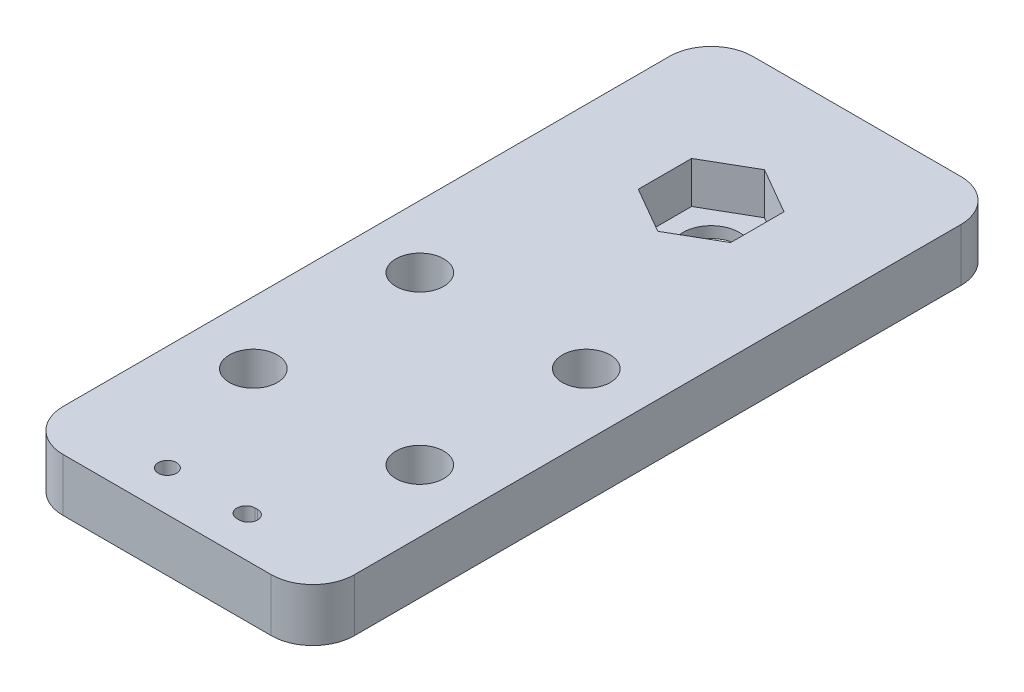
ISO-10303-21;
HEADER;
FILE_DESCRIPTION(('STEP AP214'),'2;1');
FILE_NAME('part.step','',(''),(''),'','','');
FILE_SCHEMA(('AUTOMOTIVE_DESIGN { 1 0 10303 214 1 1 1 1 }'));
ENDSEC;
DATA;
#1=APPLICATION_CONTEXT('core data for automotive mechanical design processes');
#2=APPLICATION_PROTOCOL_DEFINITION('international standard','automotive_design',2000,#1);
#3=PRODUCT_CONTEXT('',#1,'mechanical');
#4=PRODUCT('Part','Part','',(#3));
#5=PRODUCT_RELATED_PRODUCT_CATEGORY('part','',(#4));
#6=PRODUCT_DEFINITION_FORMATION('','',#4);
#7=PRODUCT_DEFINITION_CONTEXT('part definition',#1,'design');
#8=PRODUCT_DEFINITION('design','',#6,#7);
#9=PRODUCT_DEFINITION_SHAPE('','',#8);
#10=(LENGTH_UNIT() NAMED_UNIT(*) SI_UNIT(.MILLI.,.METRE.));
#11=(NAMED_UNIT(*) PLANE_ANGLE_UNIT() SI_UNIT($,.RADIAN.));
#12=(NAMED_UNIT(*) SI_UNIT($,.STERADIAN.) SOLID_ANGLE_UNIT());
#13=UNCERTAINTY_MEASURE_WITH_UNIT(LENGTH_MEASURE(1.E-05),#10,'distance_accuracy_value','');
#14=(GEOMETRIC_REPRESENTATION_CONTEXT(3) GLOBAL_UNCERTAINTY_ASSIGNED_CONTEXT((#13)) GLOBAL_UNIT_ASSIGNED_CONTEXT((#10,
#11,#12)) REPRESENTATION_CONTEXT('',''));
#15=CARTESIAN_POINT('',(0.,0.,0.));
#16=DIRECTION('',(0.,0.,1.));
#17=DIRECTION('',(1.,0.,0.));
#18=AXIS2_PLACEMENT_3D('',#15,#16,#17);
#19=CARTESIAN_POINT('',(-5.5499,6.35,-49.29564827097));
#20=DIRECTION('',(-0.500000000000017,0.,0.866025403784429));
#21=DIRECTION('',(0.866025403784429,0.,0.500000000000017));
#22=AXIS2_PLACEMENT_3D('',#19,#20,#21);
#23=PLANE('',#22);
#24=DIRECTION('',(0.866025403784811,0.,0.499999999999356));
#25=VECTOR('',#24,1.);
#26=CARTESIAN_POINT('',(-5.5499,1.35,-49.29564827097));
#27=LINE('',#26,#25);
#28=CARTESIAN_POINT('',(-5.5499,1.35,-49.29564827097));
#29=VERTEX_POINT('',#28);
#30=CARTESIAN_POINT('',(-1.22151637763079E-12,1.35,-46.0914120119979));
#31=VERTEX_POINT('',#30);
#32=EDGE_CURVE('E278',#29,#31,#27,.T.);
#33=ORIENTED_EDGE('',*,*,#32,.F.);
#34=DIRECTION('',(0.,1.,0.));
#35=VECTOR('',#34,1.);
#36=CARTESIAN_POINT('',(-5.5499,6.35,-49.29564827097));
#37=LINE('',#36,#35);
#38=CARTESIAN_POINT('',(-5.5499,6.35,-49.29564827097));
#39=VERTEX_POINT('',#38);
#40=EDGE_CURVE('E231',#29,#39,#37,.T.);
#41=ORIENTED_EDGE('',*,*,#40,.T.);
#42=DIRECTION('',(-0.866025403784811,0.,-0.499999999999356));
#43=VECTOR('',#42,1.);
#44=CARTESIAN_POINT('',(0.,6.35,-46.091412012));
#45=LINE('',#44,#43);
#46=CARTESIAN_POINT('',(-1.22155381507344E-12,6.35,-46.0914120119979));
#47=VERTEX_POINT('',#46);
#48=EDGE_CURVE('E273',#47,#39,#45,.T.);
#49=ORIENTED_EDGE('',*,*,#48,.F.);
#50=DIRECTION('',(0.,1.,0.));
#51=VECTOR('',#50,1.);
#52=CARTESIAN_POINT('',(0.,6.35,-46.091412012));
#53=LINE('',#52,#51);
#54=EDGE_CURVE('E299',#47,#31,#53,.F.);
#55=ORIENTED_EDGE('',*,*,#54,.T.);
#56=EDGE_LOOP('',(#33,#41,#49,#55));
#57=FACE_BOUND('',#56,.T.);
#58=ADVANCED_FACE('F39',(#57),#23,.F.);
#59=CARTESIAN_POINT('',(-5.5499,6.35,-55.70435172903));
#60=DIRECTION('',(-1.,0.,0.));
#61=DIRECTION('',(0.,0.,1.));
#62=AXIS2_PLACEMENT_3D('',#59,#60,#61);
#63=PLANE('',#62);
#64=DIRECTION('',(0.,0.,1.));
#65=VECTOR('',#64,1.);
#66=CARTESIAN_POINT('',(-5.5499,1.35,0.));
#67=LINE('',#66,#65);
#68=CARTESIAN_POINT('',(-5.54989999999878,1.35,-55.7043517290279));
#69=VERTEX_POINT('',#68);
#70=EDGE_CURVE('E280',#69,#29,#67,.T.);
#71=ORIENTED_EDGE('',*,*,#70,.F.);
#72=DIRECTION('',(0.,1.,0.));
#73=VECTOR('',#72,1.);
#74=CARTESIAN_POINT('',(-5.54989999999756,6.35,-55.7043517290258));
#75=LINE('',#74,#73);
#76=CARTESIAN_POINT('',(-5.54989999999939,6.35,-55.704351729029));
#77=VERTEX_POINT('',#76);
#78=EDGE_CURVE('E308',#69,#77,#75,.T.);
#79=ORIENTED_EDGE('',*,*,#78,.T.);
#80=DIRECTION('',(0.,0.,1.));
#81=VECTOR('',#80,1.);
#82=CARTESIAN_POINT('',(-5.5499,6.35,0.));
#83=LINE('',#82,#81);
#84=EDGE_CURVE('E271',#39,#77,#83,.F.);
#85=ORIENTED_EDGE('',*,*,#84,.F.);
#86=ORIENTED_EDGE('',*,*,#40,.F.);
#87=EDGE_LOOP('',(#71,#79,#85,#86));
#88=FACE_BOUND('',#87,.T.);
#89=ADVANCED_FACE('F468',(#88),#63,.F.);
#90=CARTESIAN_POINT('',(0.,6.35,-58.908587988));
#91=DIRECTION('',(-0.500000000000017,0.,-0.866025403784429));
#92=DIRECTION('',(-0.866025403784429,0.,0.500000000000017));
#93=AXIS2_PLACEMENT_3D('',#90,#91,#92);
#94=PLANE('',#93);
#95=DIRECTION('',(-0.866025403784811,0.,0.499999999999356));
#96=VECTOR('',#95,1.);
#97=CARTESIAN_POINT('',(0.,1.35,-58.908587988));
#98=LINE('',#97,#96);
#99=CARTESIAN_POINT('',(1.22151637763079E-12,1.35,-58.9085879880021));
#100=VERTEX_POINT('',#99);
#101=EDGE_CURVE('E283',#100,#69,#98,.T.);
#102=ORIENTED_EDGE('',*,*,#101,.F.);
#103=DIRECTION('',(0.,1.,0.));
#104=VECTOR('',#103,1.);
#105=CARTESIAN_POINT('',(2.44422537765132E-12,6.35,-58.9085879880042));
#106=LINE('',#105,#104);
#107=CARTESIAN_POINT('',(6.11327394955952E-13,6.35,-58.9085879880011));
#108=VERTEX_POINT('',#107);
#109=EDGE_CURVE('E305',#100,#108,#106,.T.);
#110=ORIENTED_EDGE('',*,*,#109,.T.);
#111=DIRECTION('',(0.866025403784811,0.,-0.499999999999356));
#112=VECTOR('',#111,1.);
#113=CARTESIAN_POINT('',(-5.5499,6.35,-55.70435172903));
#114=LINE('',#113,#112);
#115=EDGE_CURVE('E269',#77,#108,#114,.T.);
#116=ORIENTED_EDGE('',*,*,#115,.F.);
#117=ORIENTED_EDGE('',*,*,#78,.F.);
#118=EDGE_LOOP('',(#102,#110,#116,#117));
#119=FACE_BOUND('',#118,.T.);
#120=ADVANCED_FACE('F464',(#119),#94,.F.);
#121=CARTESIAN_POINT('',(5.5499,6.35,-55.70435172903));
#122=DIRECTION('',(0.500000000000017,0.,-0.866025403784429));
#123=DIRECTION('',(-0.866025403784429,0.,-0.500000000000017));
#124=AXIS2_PLACEMENT_3D('',#121,#122,#123);
#125=PLANE('',#124);
#126=DIRECTION('',(-0.866025403784811,0.,-0.499999999999356));
#127=VECTOR('',#126,1.);
#128=CARTESIAN_POINT('',(5.5499,1.35,-55.70435172903));
#129=LINE('',#128,#127);
#130=CARTESIAN_POINT('',(5.5499,1.35,-55.70435172903));
#131=VERTEX_POINT('',#130);
#132=EDGE_CURVE('E286',#131,#100,#129,.T.);
#133=ORIENTED_EDGE('',*,*,#132,.F.);
#134=DIRECTION('',(0.,1.,0.));
#135=VECTOR('',#134,1.);
#136=CARTESIAN_POINT('',(5.5499,6.35,-55.70435172903));
#137=LINE('',#136,#135);
#138=CARTESIAN_POINT('',(5.5499,6.35,-55.70435172903));
#139=VERTEX_POINT('',#138);
#140=EDGE_CURVE('E302',#131,#139,#137,.T.);
#141=ORIENTED_EDGE('',*,*,#140,.T.);
#142=DIRECTION('',(0.866025403784811,0.,0.499999999999356));
#143=VECTOR('',#142,1.);
#144=CARTESIAN_POINT('',(0.,6.35,-58.908587988));
#145=LINE('',#144,#143);
#146=EDGE_CURVE('E267',#108,#139,#145,.T.);
#147=ORIENTED_EDGE('',*,*,#146,.F.);
#148=ORIENTED_EDGE('',*,*,#109,.F.);
#149=EDGE_LOOP('',(#133,#141,#147,#148));
#150=FACE_BOUND('',#149,.T.);
#151=ADVANCED_FACE('F460',(#150),#125,.F.);
#152=CARTESIAN_POINT('',(5.5499,6.35,-49.29564827097));
#153=DIRECTION('',(1.,0.,0.));
#154=DIRECTION('',(0.,0.,-1.));
#155=AXIS2_PLACEMENT_3D('',#152,#153,#154);
#156=PLANE('',#155);
#157=DIRECTION('',(0.,0.,1.));
#158=VECTOR('',#157,1.);
#159=CARTESIAN_POINT('',(5.5499,1.35,0.));
#160=LINE('',#159,#158);
#161=CARTESIAN_POINT('',(5.54989999999939,1.35,-49.2956482709711));
#162=VERTEX_POINT('',#161);
#163=EDGE_CURVE('E289',#162,#131,#160,.F.);
#164=ORIENTED_EDGE('',*,*,#163,.F.);
#165=DIRECTION('',(0.,1.,0.));
#166=VECTOR('',#165,1.);
#167=CARTESIAN_POINT('',(5.54989999999756,6.35,-49.2956482709742));
#168=LINE('',#167,#166);
#169=CARTESIAN_POINT('',(5.54989999999939,6.35,-49.2956482709711));
#170=VERTEX_POINT('',#169);
#171=EDGE_CURVE('E292',#162,#170,#168,.T.);
#172=ORIENTED_EDGE('',*,*,#171,.T.);
#173=DIRECTION('',(0.,0.,1.));
#174=VECTOR('',#173,1.);
#175=CARTESIAN_POINT('',(5.5499,6.35,0.));
#176=LINE('',#175,#174);
#177=EDGE_CURVE('E265',#139,#170,#176,.T.);
#178=ORIENTED_EDGE('',*,*,#177,.F.);
#179=ORIENTED_EDGE('',*,*,#140,.F.);
#180=EDGE_LOOP('',(#164,#172,#178,#179));
#181=FACE_BOUND('',#180,.T.);
#182=ADVANCED_FACE('F456',(#181),#156,.F.);
#183=CARTESIAN_POINT('',(0.,6.35,-46.091412012));
#184=DIRECTION('',(0.500000000000017,0.,0.866025403784429));
#185=DIRECTION('',(0.866025403784429,0.,-0.500000000000017));
#186=AXIS2_PLACEMENT_3D('',#183,#184,#185);
#187=PLANE('',#186);
#188=DIRECTION('',(0.866025403784811,0.,-0.499999999999356));
#189=VECTOR('',#188,1.);
#190=CARTESIAN_POINT('',(0.,1.35,-46.091412012));
#191=LINE('',#190,#189);
#192=EDGE_CURVE('E275',#31,#162,#191,.T.);
#193=ORIENTED_EDGE('',*,*,#192,.F.);
#194=ORIENTED_EDGE('',*,*,#54,.F.);
#195=DIRECTION('',(-0.866025403784811,0.,0.499999999999356));
#196=VECTOR('',#195,1.);
#197=CARTESIAN_POINT('',(5.5499,6.35,-49.29564827097));
#198=LINE('',#197,#196);
#199=EDGE_CURVE('E261',#170,#47,#198,.T.);
#200=ORIENTED_EDGE('',*,*,#199,.F.);
#201=ORIENTED_EDGE('',*,*,#171,.F.);
#202=EDGE_LOOP('',(#193,#194,#200,#201));
#203=FACE_BOUND('',#202,.T.);
#204=ADVANCED_FACE('F452',(#203),#187,.F.);
#205=CARTESIAN_POINT('',(0.,1.35,0.));
#206=DIRECTION('',(0.,1.,0.));
#207=DIRECTION('',(0.,0.,1.));
#208=AXIS2_PLACEMENT_3D('',#205,#206,#207);
#209=PLANE('',#208);
#210=CARTESIAN_POINT('',(0.,1.35,-52.5));
#211=DIRECTION('',(0.,-1.,0.));
#212=DIRECTION('',(0.,0.,-1.));
#213=AXIS2_PLACEMENT_3D('',#210,#211,#212);
#214=CIRCLE('',#213,3.375);
#215=CARTESIAN_POINT('',(0.,1.35,-55.875));
#216=VERTEX_POINT('',#215);
#217=EDGE_CURVE('E334',#216,#216,#214,.T.);
#218=ORIENTED_EDGE('',*,*,#217,.T.);
#219=EDGE_LOOP('',(#218));
#220=FACE_BOUND('',#219,.T.);
#221=ORIENTED_EDGE('',*,*,#32,.T.);
#222=ORIENTED_EDGE('',*,*,#192,.T.);
#223=ORIENTED_EDGE('',*,*,#163,.T.);
#224=ORIENTED_EDGE('',*,*,#132,.T.);
#225=ORIENTED_EDGE('',*,*,#101,.T.);
#226=ORIENTED_EDGE('',*,*,#70,.T.);
#227=EDGE_LOOP('',(#221,#222,#223,#224,#225,#226));
#228=FACE_BOUND('',#227,.T.);
#229=ADVANCED_FACE('F448',(#220,#228),#209,.T.);
#230=CARTESIAN_POINT('',(0.,6.35,0.));
#231=DIRECTION('',(0.,1.,0.));
#232=DIRECTION('',(0.,0.,1.));
#233=AXIS2_PLACEMENT_3D('',#230,#231,#232);
#234=PLANE('',#233);
#235=CARTESIAN_POINT('',(4.60753253948754,6.35,7.98214084471738));
#236=DIRECTION('',(0.,1.,0.));
#237=DIRECTION('',(0.,0.,1.));
#238=AXIS2_PLACEMENT_3D('',#235,#236,#237);
#239=CIRCLE('',#238,1.1049);
#240=CARTESIAN_POINT('',(4.60753253948754,6.35,6.87724084471738));
#241=VERTEX_POINT('',#240);
#242=CARTESIAN_POINT('',(4.60753253948754,6.35,9.08704084471738));
#243=VERTEX_POINT('',#242);
#244=EDGE_CURVE('E216',#241,#243,#239,.T.);
#245=ORIENTED_EDGE('',*,*,#244,.F.);
#246=DIRECTION('',(-1.,0.,0.));
#247=VECTOR('',#246,1.);
#248=CARTESIAN_POINT('',(0.,6.35,6.87724084471738));
#249=LINE('',#248,#247);
#250=CARTESIAN_POINT('',(4.88693253948754,6.35,6.87724084471738));
#251=VERTEX_POINT('',#250);
#252=EDGE_CURVE('E205',#251,#241,#249,.T.);
#253=ORIENTED_EDGE('',*,*,#252,.F.);
#254=CARTESIAN_POINT('',(4.88693253948754,6.35,7.98214084471738));
#255=DIRECTION('',(0.,1.,0.));
#256=DIRECTION('',(0.,0.,1.));
#257=AXIS2_PLACEMENT_3D('',#254,#255,#256);
#258=CIRCLE('',#257,1.1049);
#259=CARTESIAN_POINT('',(4.88693253948754,6.35,9.08704084471738));
#260=VERTEX_POINT('',#259);
#261=EDGE_CURVE('E178',#260,#251,#258,.T.);
#262=ORIENTED_EDGE('',*,*,#261,.F.);
#263=DIRECTION('',(1.,0.,0.));
#264=VECTOR('',#263,1.);
#265=CARTESIAN_POINT('',(0.,6.35,9.08704084471738));
#266=LINE('',#265,#264);
#267=EDGE_CURVE('E213',#243,#260,#266,.T.);
#268=ORIENTED_EDGE('',*,*,#267,.F.);
#269=EDGE_LOOP('',(#245,#253,#262,#268));
#270=FACE_BOUND('',#269,.T.);
#271=CARTESIAN_POINT('',(-4.84126746051246,6.35,7.98214084471738));
#272=DIRECTION('',(0.,1.,0.));
#273=DIRECTION('',(0.,0.,1.));
#274=AXIS2_PLACEMENT_3D('',#271,#272,#273);
#275=CIRCLE('',#274,1.1049);
#276=CARTESIAN_POINT('',(-4.84126746051246,6.35,9.08704084471738));
#277=VERTEX_POINT('',#276);
#278=EDGE_CURVE('E223',#277,#277,#275,.T.);
#279=ORIENTED_EDGE('',*,*,#278,.F.);
#280=EDGE_LOOP('',(#279));
#281=FACE_BOUND('',#280,.T.);
#282=DIRECTION('',(0.,0.,1.));
#283=VECTOR('',#282,1.);
#284=CARTESIAN_POINT('',(-17.5,6.35,-70.));
#285=LINE('',#284,#283);
#286=CARTESIAN_POINT('',(-17.5,6.35,7.84920220870589));
#287=VERTEX_POINT('',#286);
#288=CARTESIAN_POINT('',(-17.5,6.35,-65.));
#289=VERTEX_POINT('',#288);
#290=EDGE_CURVE('E250',#287,#289,#285,.F.);
#291=ORIENTED_EDGE('',*,*,#290,.F.);
#292=CARTESIAN_POINT('',(-12.5,6.35,7.84920220870589));
#293=DIRECTION('',(0.,1.,0.));
#294=DIRECTION('',(0.,0.,1.));
#295=AXIS2_PLACEMENT_3D('',#292,#293,#294);
#296=CIRCLE('',#295,5.);
#297=CARTESIAN_POINT('',(-12.5,6.35,12.8492022087059));
#298=VERTEX_POINT('',#297);
#299=EDGE_CURVE('E47',#287,#298,#296,.T.);
#300=ORIENTED_EDGE('',*,*,#299,.T.);
#301=DIRECTION('',(1.,0.,0.));
#302=VECTOR('',#301,1.);
#303=CARTESIAN_POINT('',(0.,6.35,12.8492022087059));
#304=LINE('',#303,#302);
#305=CARTESIAN_POINT('',(12.5,6.35,12.8492022087059));
#306=VERTEX_POINT('',#305);
#307=EDGE_CURVE('E228',#298,#306,#304,.T.);
#308=ORIENTED_EDGE('',*,*,#307,.T.);
#309=CARTESIAN_POINT('',(12.5,6.35,7.84920220870589));
#310=DIRECTION('',(0.,1.,0.));
#311=DIRECTION('',(0.,0.,1.));
#312=AXIS2_PLACEMENT_3D('',#309,#310,#311);
#313=CIRCLE('',#312,5.);
#314=CARTESIAN_POINT('',(17.5,6.35,7.84920220870589));
#315=VERTEX_POINT('',#314);
#316=EDGE_CURVE('E357',#306,#315,#313,.T.);
#317=ORIENTED_EDGE('',*,*,#316,.T.);
#318=DIRECTION('',(0.,0.,-1.));
#319=VECTOR('',#318,1.);
#320=CARTESIAN_POINT('',(17.5,6.35,0.));
#321=LINE('',#320,#319);
#322=CARTESIAN_POINT('',(17.5,6.35,-65.));
#323=VERTEX_POINT('',#322);
#324=EDGE_CURVE('E264',#323,#315,#321,.F.);
#325=ORIENTED_EDGE('',*,*,#324,.F.);
#326=CARTESIAN_POINT('',(12.5,6.35,-65.));
#327=DIRECTION('',(0.,-1.,0.));
#328=DIRECTION('',(0.,0.,-1.));
#329=AXIS2_PLACEMENT_3D('',#326,#327,#328);
#330=CIRCLE('',#329,5.);
#331=CARTESIAN_POINT('',(12.5,6.35,-70.));
#332=VERTEX_POINT('',#331);
#333=EDGE_CURVE('E260',#332,#323,#330,.T.);
#334=ORIENTED_EDGE('',*,*,#333,.F.);
#335=DIRECTION('',(-1.,0.,0.));
#336=VECTOR('',#335,1.);
#337=CARTESIAN_POINT('',(17.5,6.35,-70.));
#338=LINE('',#337,#336);
#339=CARTESIAN_POINT('',(-12.5,6.35,-70.));
#340=VERTEX_POINT('',#339);
#341=EDGE_CURVE('E256',#340,#332,#338,.F.);
#342=ORIENTED_EDGE('',*,*,#341,.F.);
#343=CARTESIAN_POINT('',(-12.5,6.35,-65.));
#344=DIRECTION('',(0.,-1.,0.));
#345=DIRECTION('',(0.,0.,-1.));
#346=AXIS2_PLACEMENT_3D('',#343,#344,#345);
#347=CIRCLE('',#346,5.);
#348=EDGE_CURVE('E253',#289,#340,#347,.T.);
#349=ORIENTED_EDGE('',*,*,#348,.F.);
#350=EDGE_LOOP('',(#291,#300,#308,#317,#325,#334,#342,#349));
#351=FACE_BOUND('',#350,.T.);
#352=ORIENTED_EDGE('',*,*,#177,.T.);
#353=ORIENTED_EDGE('',*,*,#199,.T.);
#354=ORIENTED_EDGE('',*,*,#48,.T.);
#355=ORIENTED_EDGE('',*,*,#84,.T.);
#356=ORIENTED_EDGE('',*,*,#115,.T.);
#357=ORIENTED_EDGE('',*,*,#146,.T.);
#358=EDGE_LOOP('',(#352,#353,#354,#355,#356,#357));
#359=FACE_BOUND('',#358,.T.);
#360=CARTESIAN_POINT('',(10.,6.35,-7.5));
#361=DIRECTION('',(0.,-1.,0.));
#362=DIRECTION('',(0.,0.,-1.));
#363=AXIS2_PLACEMENT_3D('',#360,#361,#362);
#364=CIRCLE('',#363,2.875);
#365=CARTESIAN_POINT('',(10.,6.35,-10.375));
#366=VERTEX_POINT('',#365);
#367=EDGE_CURVE('E246',#366,#366,#364,.T.);
#368=ORIENTED_EDGE('',*,*,#367,.T.);
#369=EDGE_LOOP('',(#368));
#370=FACE_BOUND('',#369,.T.);
#371=CARTESIAN_POINT('',(-10.,6.35,-27.5));
#372=DIRECTION('',(0.,-1.,0.));
#373=DIRECTION('',(0.,0.,-1.));
#374=AXIS2_PLACEMENT_3D('',#371,#372,#373);
#375=CIRCLE('',#374,2.875);
#376=CARTESIAN_POINT('',(-10.,6.35,-30.375));
#377=VERTEX_POINT('',#376);
#378=EDGE_CURVE('E337',#377,#377,#375,.T.);
#379=ORIENTED_EDGE('',*,*,#378,.T.);
#380=EDGE_LOOP('',(#379));
#381=FACE_BOUND('',#380,.T.);
#382=CARTESIAN_POINT('',(-10.,6.35,-7.5));
#383=DIRECTION('',(0.,-1.,0.));
#384=DIRECTION('',(0.,0.,-1.));
#385=AXIS2_PLACEMENT_3D('',#382,#383,#384);
#386=CIRCLE('',#385,2.875);
#387=CARTESIAN_POINT('',(-10.,6.35,-10.375));
#388=VERTEX_POINT('',#387);
#389=EDGE_CURVE('E340',#388,#388,#386,.T.);
#390=ORIENTED_EDGE('',*,*,#389,.T.);
#391=EDGE_LOOP('',(#390));
#392=FACE_BOUND('',#391,.T.);
#393=CARTESIAN_POINT('',(10.,6.35,-27.5));
#394=DIRECTION('',(0.,-1.,0.));
#395=DIRECTION('',(0.,0.,-1.));
#396=AXIS2_PLACEMENT_3D('',#393,#394,#395);
#397=CIRCLE('',#396,2.875);
#398=CARTESIAN_POINT('',(10.,6.35,-30.375));
#399=VERTEX_POINT('',#398);
#400=EDGE_CURVE('E249',#399,#399,#397,.T.);
#401=ORIENTED_EDGE('',*,*,#400,.T.);
#402=EDGE_LOOP('',(#401));
#403=FACE_BOUND('',#402,.T.);
#404=ADVANCED_FACE('F362',(#270,#281,#351,#359,#370,#381,#392,#403),#234,.T.);
#405=CARTESIAN_POINT('',(17.5,0.,0.));
#406=DIRECTION('',(1.,0.,0.));
#407=DIRECTION('',(0.,0.,-1.));
#408=AXIS2_PLACEMENT_3D('',#405,#406,#407);
#409=PLANE('',#408);
#410=ORIENTED_EDGE('',*,*,#324,.T.);
#411=DIRECTION('',(0.,-1.,0.));
#412=VECTOR('',#411,1.);
#413=CARTESIAN_POINT('',(17.5,0.,7.84920220870589));
#414=LINE('',#413,#412);
#415=CARTESIAN_POINT('',(17.5,0.,7.84920220870589));
#416=VERTEX_POINT('',#415);
#417=EDGE_CURVE('E11',#315,#416,#414,.T.);
#418=ORIENTED_EDGE('',*,*,#417,.T.);
#419=DIRECTION('',(0.,0.,1.));
#420=VECTOR('',#419,1.);
#421=CARTESIAN_POINT('',(17.5,0.,0.));
#422=LINE('',#421,#420);
#423=CARTESIAN_POINT('',(17.5,0.,-65.));
#424=VERTEX_POINT('',#423);
#425=EDGE_CURVE('E243',#416,#424,#422,.F.);
#426=ORIENTED_EDGE('',*,*,#425,.T.);
#427=DIRECTION('',(0.,-1.,0.));
#428=VECTOR('',#427,1.);
#429=CARTESIAN_POINT('',(17.5,14.62786,-65.));
#430=LINE('',#429,#428);
#431=EDGE_CURVE('E257',#323,#424,#430,.T.);
#432=ORIENTED_EDGE('',*,*,#431,.F.);
#433=EDGE_LOOP('',(#410,#418,#426,#432));
#434=FACE_BOUND('',#433,.T.);
#435=ADVANCED_FACE('F397',(#434),#409,.T.);
#436=CARTESIAN_POINT('',(12.5,14.62786,-65.));
#437=DIRECTION('',(0.,-1.,0.));
#438=DIRECTION('',(0.,0.,-1.));
#439=AXIS2_PLACEMENT_3D('',#436,#437,#438);
#440=CYLINDRICAL_SURFACE('',#439,5.);
#441=ORIENTED_EDGE('',*,*,#431,.T.);
#442=CARTESIAN_POINT('',(12.5,0.,-65.));
#443=DIRECTION('',(0.,-1.,0.));
#444=DIRECTION('',(0.,0.,-1.));
#445=AXIS2_PLACEMENT_3D('',#442,#443,#444);
#446=CIRCLE('',#445,5.);
#447=CARTESIAN_POINT('',(12.5,0.,-70.));
#448=VERTEX_POINT('',#447);
#449=EDGE_CURVE('E242',#424,#448,#446,.F.);
#450=ORIENTED_EDGE('',*,*,#449,.T.);
#451=DIRECTION('',(0.,1.,0.));
#452=VECTOR('',#451,1.);
#453=CARTESIAN_POINT('',(12.5,0.,-70.));
#454=LINE('',#453,#452);
#455=EDGE_CURVE('E254',#332,#448,#454,.F.);
#456=ORIENTED_EDGE('',*,*,#455,.F.);
#457=ORIENTED_EDGE('',*,*,#333,.T.);
#458=EDGE_LOOP('',(#441,#450,#456,#457));
#459=FACE_BOUND('',#458,.T.);
#460=ADVANCED_FACE('F392',(#459),#440,.T.);
#461=CARTESIAN_POINT('',(17.5,0.,-70.));
#462=DIRECTION('',(0.,0.,-1.));
#463=DIRECTION('',(-1.,0.,0.));
#464=AXIS2_PLACEMENT_3D('',#461,#462,#463);
#465=PLANE('',#464);
#466=ORIENTED_EDGE('',*,*,#341,.T.);
#467=ORIENTED_EDGE('',*,*,#455,.T.);
#468=DIRECTION('',(1.,0.,0.));
#469=VECTOR('',#468,1.);
#470=CARTESIAN_POINT('',(0.,0.,-70.));
#471=LINE('',#470,#469);
#472=CARTESIAN_POINT('',(-12.5,0.,-70.));
#473=VERTEX_POINT('',#472);
#474=EDGE_CURVE('E239',#448,#473,#471,.F.);
#475=ORIENTED_EDGE('',*,*,#474,.T.);
#476=DIRECTION('',(0.,-1.,0.));
#477=VECTOR('',#476,1.);
#478=CARTESIAN_POINT('',(-12.5,14.62786,-70.));
#479=LINE('',#478,#477);
#480=EDGE_CURVE('E251',#340,#473,#479,.T.);
#481=ORIENTED_EDGE('',*,*,#480,.F.);
#482=EDGE_LOOP('',(#466,#467,#475,#481));
#483=FACE_BOUND('',#482,.T.);
#484=ADVANCED_FACE('F388',(#483),#465,.T.);
#485=CARTESIAN_POINT('',(-12.5,14.62786,-65.));
#486=DIRECTION('',(0.,-1.,0.));
#487=DIRECTION('',(0.,0.,-1.));
#488=AXIS2_PLACEMENT_3D('',#485,#486,#487);
#489=CYLINDRICAL_SURFACE('',#488,5.);
#490=ORIENTED_EDGE('',*,*,#480,.T.);
#491=CARTESIAN_POINT('',(-12.5,0.,-65.));
#492=DIRECTION('',(0.,-1.,0.));
#493=DIRECTION('',(0.,0.,-1.));
#494=AXIS2_PLACEMENT_3D('',#491,#492,#493);
#495=CIRCLE('',#494,5.);
#496=CARTESIAN_POINT('',(-17.5,0.,-65.));
#497=VERTEX_POINT('',#496);
#498=EDGE_CURVE('E238',#473,#497,#495,.F.);
#499=ORIENTED_EDGE('',*,*,#498,.T.);
#500=DIRECTION('',(0.,1.,0.));
#501=VECTOR('',#500,1.);
#502=CARTESIAN_POINT('',(-17.5,0.,-65.));
#503=LINE('',#502,#501);
#504=EDGE_CURVE('E247',#289,#497,#503,.F.);
#505=ORIENTED_EDGE('',*,*,#504,.F.);
#506=ORIENTED_EDGE('',*,*,#348,.T.);
#507=EDGE_LOOP('',(#490,#499,#505,#506));
#508=FACE_BOUND('',#507,.T.);
#509=ADVANCED_FACE('F382',(#508),#489,.T.);
#510=CARTESIAN_POINT('',(-17.5,0.,-70.));
#511=DIRECTION('',(-1.,0.,0.));
#512=DIRECTION('',(0.,0.,1.));
#513=AXIS2_PLACEMENT_3D('',#510,#511,#512);
#514=PLANE('',#513);
#515=DIRECTION('',(0.,0.,1.));
#516=VECTOR('',#515,1.);
#517=CARTESIAN_POINT('',(-17.5,0.,0.));
#518=LINE('',#517,#516);
#519=CARTESIAN_POINT('',(-17.5,0.,7.84920220870589));
#520=VERTEX_POINT('',#519);
#521=EDGE_CURVE('E234',#497,#520,#518,.T.);
#522=ORIENTED_EDGE('',*,*,#521,.T.);
#523=DIRECTION('',(0.,-1.,0.));
#524=VECTOR('',#523,1.);
#525=CARTESIAN_POINT('',(-17.5,6.35,7.84920220870589));
#526=LINE('',#525,#524);
#527=EDGE_CURVE('E355',#520,#287,#526,.F.);
#528=ORIENTED_EDGE('',*,*,#527,.T.);
#529=ORIENTED_EDGE('',*,*,#290,.T.);
#530=ORIENTED_EDGE('',*,*,#504,.T.);
#531=EDGE_LOOP('',(#522,#528,#529,#530));
#532=FACE_BOUND('',#531,.T.);
#533=ADVANCED_FACE('F379',(#532),#514,.T.);
#534=CARTESIAN_POINT('',(10.,6.35,-27.5));
#535=DIRECTION('',(0.,-1.,0.));
#536=DIRECTION('',(0.,0.,-1.));
#537=AXIS2_PLACEMENT_3D('',#534,#535,#536);
#538=CYLINDRICAL_SURFACE('',#537,2.875);
#539=ORIENTED_EDGE('',*,*,#400,.F.);
#540=EDGE_LOOP('',(#539));
#541=FACE_BOUND('',#540,.T.);
#542=CARTESIAN_POINT('',(10.,0.,-27.5));
#543=DIRECTION('',(0.,-1.,0.));
#544=DIRECTION('',(0.,0.,-1.));
#545=AXIS2_PLACEMENT_3D('',#542,#543,#544);
#546=CIRCLE('',#545,2.875);
#547=CARTESIAN_POINT('',(10.,0.,-30.375));
#548=VERTEX_POINT('',#547);
#549=EDGE_CURVE('E237',#548,#548,#546,.T.);
#550=ORIENTED_EDGE('',*,*,#549,.T.);
#551=EDGE_LOOP('',(#550));
#552=FACE_BOUND('',#551,.T.);
#553=ADVANCED_FACE('F431',(#541,#552),#538,.F.);
#554=CARTESIAN_POINT('',(-10.,6.35,-7.5));
#555=DIRECTION('',(0.,-1.,0.));
#556=DIRECTION('',(0.,0.,-1.));
#557=AXIS2_PLACEMENT_3D('',#554,#555,#556);
#558=CYLINDRICAL_SURFACE('',#557,2.875);
#559=ORIENTED_EDGE('',*,*,#389,.F.);
#560=EDGE_LOOP('',(#559));
#561=FACE_BOUND('',#560,.T.);
#562=CARTESIAN_POINT('',(-10.,0.,-7.5));
#563=DIRECTION('',(0.,-1.,0.));
#564=DIRECTION('',(0.,0.,-1.));
#565=AXIS2_PLACEMENT_3D('',#562,#563,#564);
#566=CIRCLE('',#565,2.875);
#567=CARTESIAN_POINT('',(-10.,0.,-10.375));
#568=VERTEX_POINT('',#567);
#569=EDGE_CURVE('E323',#568,#568,#566,.T.);
#570=ORIENTED_EDGE('',*,*,#569,.T.);
#571=EDGE_LOOP('',(#570));
#572=FACE_BOUND('',#571,.T.);
#573=ADVANCED_FACE('F427',(#561,#572),#558,.F.);
#574=CARTESIAN_POINT('',(-10.,6.35,-27.5));
#575=DIRECTION('',(0.,-1.,0.));
#576=DIRECTION('',(0.,0.,-1.));
#577=AXIS2_PLACEMENT_3D('',#574,#575,#576);
#578=CYLINDRICAL_SURFACE('',#577,2.875);
#579=ORIENTED_EDGE('',*,*,#378,.F.);
#580=EDGE_LOOP('',(#579));
#581=FACE_BOUND('',#580,.T.);
#582=CARTESIAN_POINT('',(-10.,0.,-27.5));
#583=DIRECTION('',(0.,-1.,0.));
#584=DIRECTION('',(0.,0.,-1.));
#585=AXIS2_PLACEMENT_3D('',#582,#583,#584);
#586=CIRCLE('',#585,2.875);
#587=CARTESIAN_POINT('',(-10.,0.,-30.375));
#588=VERTEX_POINT('',#587);
#589=EDGE_CURVE('E320',#588,#588,#586,.T.);
#590=ORIENTED_EDGE('',*,*,#589,.T.);
#591=EDGE_LOOP('',(#590));
#592=FACE_BOUND('',#591,.T.);
#593=ADVANCED_FACE('F423',(#581,#592),#578,.F.);
#594=CARTESIAN_POINT('',(0.,6.35,-52.5));
#595=DIRECTION('',(0.,-1.,0.));
#596=DIRECTION('',(0.,0.,-1.));
#597=AXIS2_PLACEMENT_3D('',#594,#595,#596);
#598=CYLINDRICAL_SURFACE('',#597,3.375);
#599=CARTESIAN_POINT('',(0.,0.,-52.5));
#600=DIRECTION('',(0.,-1.,0.));
#601=DIRECTION('',(0.,0.,-1.));
#602=AXIS2_PLACEMENT_3D('',#599,#600,#601);
#603=CIRCLE('',#602,3.375);
#604=CARTESIAN_POINT('',(0.,0.,-55.875));
#605=VERTEX_POINT('',#604);
#606=EDGE_CURVE('E317',#605,#605,#603,.T.);
#607=ORIENTED_EDGE('',*,*,#606,.T.);
#608=EDGE_LOOP('',(#607));
#609=FACE_BOUND('',#608,.T.);
#610=ORIENTED_EDGE('',*,*,#217,.F.);
#611=EDGE_LOOP('',(#610));
#612=FACE_BOUND('',#611,.T.);
#613=ADVANCED_FACE('F417',(#609,#612),#598,.F.);
#614=CARTESIAN_POINT('',(10.,6.35,-7.5));
#615=DIRECTION('',(0.,-1.,0.));
#616=DIRECTION('',(0.,0.,-1.));
#617=AXIS2_PLACEMENT_3D('',#614,#615,#616);
#618=CYLINDRICAL_SURFACE('',#617,2.875);
#619=ORIENTED_EDGE('',*,*,#367,.F.);
#620=EDGE_LOOP('',(#619));
#621=FACE_BOUND('',#620,.T.);
#622=CARTESIAN_POINT('',(10.,0.,-7.5));
#623=DIRECTION('',(0.,-1.,0.));
#624=DIRECTION('',(0.,0.,-1.));
#625=AXIS2_PLACEMENT_3D('',#622,#623,#624);
#626=CIRCLE('',#625,2.875);
#627=CARTESIAN_POINT('',(10.,0.,-10.375));
#628=VERTEX_POINT('',#627);
#629=EDGE_CURVE('E313',#628,#628,#626,.T.);
#630=ORIENTED_EDGE('',*,*,#629,.T.);
#631=EDGE_LOOP('',(#630));
#632=FACE_BOUND('',#631,.T.);
#633=ADVANCED_FACE('F410',(#621,#632),#618,.F.);
#634=CARTESIAN_POINT('',(0.,0.,0.));
#635=DIRECTION('',(0.,1.,0.));
#636=DIRECTION('',(0.,0.,1.));
#637=AXIS2_PLACEMENT_3D('',#634,#635,#636);
#638=PLANE('',#637);
#639=DIRECTION('',(1.,0.,0.));
#640=VECTOR('',#639,1.);
#641=CARTESIAN_POINT('',(4.60753253948754,0.,6.87724084471738));
#642=LINE('',#641,#640);
#643=CARTESIAN_POINT('',(4.60753253948754,0.,6.87724084471738));
#644=VERTEX_POINT('',#643);
#645=CARTESIAN_POINT('',(4.88693253948754,0.,6.87724084471738));
#646=VERTEX_POINT('',#645);
#647=EDGE_CURVE('E185',#644,#646,#642,.T.);
#648=ORIENTED_EDGE('',*,*,#647,.F.);
#649=CARTESIAN_POINT('',(4.60753253948754,0.,7.98214084471738));
#650=DIRECTION('',(0.,-1.,0.));
#651=DIRECTION('',(0.,0.,1.));
#652=AXIS2_PLACEMENT_3D('',#649,#650,#651);
#653=CIRCLE('',#652,1.1049);
#654=CARTESIAN_POINT('',(4.60753253948754,0.,9.08704084471738));
#655=VERTEX_POINT('',#654);
#656=EDGE_CURVE('E67',#655,#644,#653,.T.);
#657=ORIENTED_EDGE('',*,*,#656,.F.);
#658=DIRECTION('',(-1.,0.,0.));
#659=VECTOR('',#658,1.);
#660=CARTESIAN_POINT('',(4.60753253948754,0.,9.08704084471738));
#661=LINE('',#660,#659);
#662=CARTESIAN_POINT('',(4.88693253948754,0.,9.08704084471738));
#663=VERTEX_POINT('',#662);
#664=EDGE_CURVE('E193',#663,#655,#661,.T.);
#665=ORIENTED_EDGE('',*,*,#664,.F.);
#666=CARTESIAN_POINT('',(4.88693253948754,0.,7.98214084471738));
#667=DIRECTION('',(0.,-1.,0.));
#668=DIRECTION('',(0.,0.,-1.));
#669=AXIS2_PLACEMENT_3D('',#666,#667,#668);
#670=CIRCLE('',#669,1.1049);
#671=EDGE_CURVE('E175',#646,#663,#670,.T.);
#672=ORIENTED_EDGE('',*,*,#671,.F.);
#673=EDGE_LOOP('',(#648,#657,#665,#672));
#674=FACE_BOUND('',#673,.T.);
#675=CARTESIAN_POINT('',(-4.84126746051246,0.,7.98214084471738));
#676=DIRECTION('',(0.,-1.,0.));
#677=DIRECTION('',(0.,0.,-1.));
#678=AXIS2_PLACEMENT_3D('',#675,#676,#677);
#679=CIRCLE('',#678,1.1049);
#680=CARTESIAN_POINT('',(-4.84126746051246,0.,6.87724084471738));
#681=VERTEX_POINT('',#680);
#682=EDGE_CURVE('E219',#681,#681,#679,.T.);
#683=ORIENTED_EDGE('',*,*,#682,.F.);
#684=EDGE_LOOP('',(#683));
#685=FACE_BOUND('',#684,.T.);
#686=DIRECTION('',(1.,0.,0.));
#687=VECTOR('',#686,1.);
#688=CARTESIAN_POINT('',(0.,0.,12.8492022087059));
#689=LINE('',#688,#687);
#690=CARTESIAN_POINT('',(-12.5,0.,12.8492022087059));
#691=VERTEX_POINT('',#690);
#692=CARTESIAN_POINT('',(12.5,0.,12.8492022087059));
#693=VERTEX_POINT('',#692);
#694=EDGE_CURVE('E227',#691,#693,#689,.T.);
#695=ORIENTED_EDGE('',*,*,#694,.F.);
#696=CARTESIAN_POINT('',(-12.5,0.,7.84920220870589));
#697=DIRECTION('',(0.,1.,0.));
#698=DIRECTION('',(0.,0.,1.));
#699=AXIS2_PLACEMENT_3D('',#696,#697,#698);
#700=CIRCLE('',#699,5.);
#701=EDGE_CURVE('E353',#691,#520,#700,.F.);
#702=ORIENTED_EDGE('',*,*,#701,.T.);
#703=ORIENTED_EDGE('',*,*,#521,.F.);
#704=ORIENTED_EDGE('',*,*,#498,.F.);
#705=ORIENTED_EDGE('',*,*,#474,.F.);
#706=ORIENTED_EDGE('',*,*,#449,.F.);
#707=ORIENTED_EDGE('',*,*,#425,.F.);
#708=CARTESIAN_POINT('',(12.5,0.,7.84920220870589));
#709=DIRECTION('',(0.,1.,0.));
#710=DIRECTION('',(0.,0.,1.));
#711=AXIS2_PLACEMENT_3D('',#708,#709,#710);
#712=CIRCLE('',#711,5.);
#713=EDGE_CURVE('E351',#416,#693,#712,.F.);
#714=ORIENTED_EDGE('',*,*,#713,.T.);
#715=EDGE_LOOP('',(#695,#702,#703,#704,#705,#706,#707,#714));
#716=FACE_BOUND('',#715,.T.);
#717=ORIENTED_EDGE('',*,*,#629,.F.);
#718=EDGE_LOOP('',(#717));
#719=FACE_BOUND('',#718,.T.);
#720=ORIENTED_EDGE('',*,*,#606,.F.);
#721=EDGE_LOOP('',(#720));
#722=FACE_BOUND('',#721,.T.);
#723=ORIENTED_EDGE('',*,*,#589,.F.);
#724=EDGE_LOOP('',(#723));
#725=FACE_BOUND('',#724,.T.);
#726=ORIENTED_EDGE('',*,*,#569,.F.);
#727=EDGE_LOOP('',(#726));
#728=FACE_BOUND('',#727,.T.);
#729=ORIENTED_EDGE('',*,*,#549,.F.);
#730=EDGE_LOOP('',(#729));
#731=FACE_BOUND('',#730,.T.);
#732=ADVANCED_FACE('F190',(#674,#685,#716,#719,#722,#725,#728,#731),#638,.F.);
#733=CARTESIAN_POINT('',(0.,6.35,12.8492022087059));
#734=DIRECTION('',(0.,0.,-1.));
#735=DIRECTION('',(-1.,0.,0.));
#736=AXIS2_PLACEMENT_3D('',#733,#734,#735);
#737=PLANE('',#736);
#738=ORIENTED_EDGE('',*,*,#307,.F.);
#739=DIRECTION('',(0.,-1.,0.));
#740=VECTOR('',#739,1.);
#741=CARTESIAN_POINT('',(-12.5,0.,12.8492022087059));
#742=LINE('',#741,#740);
#743=EDGE_CURVE('E348',#298,#691,#742,.T.);
#744=ORIENTED_EDGE('',*,*,#743,.T.);
#745=ORIENTED_EDGE('',*,*,#694,.T.);
#746=DIRECTION('',(0.,-1.,0.));
#747=VECTOR('',#746,1.);
#748=CARTESIAN_POINT('',(12.5,6.35,12.8492022087059));
#749=LINE('',#748,#747);
#750=EDGE_CURVE('E316',#693,#306,#749,.F.);
#751=ORIENTED_EDGE('',*,*,#750,.T.);
#752=EDGE_LOOP('',(#738,#744,#745,#751));
#753=FACE_BOUND('',#752,.T.);
#754=ADVANCED_FACE('F370',(#753),#737,.F.);
#755=CARTESIAN_POINT('',(-12.5,6.35,7.84920220870589));
#756=DIRECTION('',(0.,1.,0.));
#757=DIRECTION('',(0.,0.,1.));
#758=AXIS2_PLACEMENT_3D('',#755,#756,#757);
#759=CYLINDRICAL_SURFACE('',#758,5.);
#760=ORIENTED_EDGE('',*,*,#299,.F.);
#761=ORIENTED_EDGE('',*,*,#527,.F.);
#762=ORIENTED_EDGE('',*,*,#701,.F.);
#763=ORIENTED_EDGE('',*,*,#743,.F.);
#764=EDGE_LOOP('',(#760,#761,#762,#763));
#765=FACE_BOUND('',#764,.T.);
#766=ADVANCED_FACE('F373',(#765),#759,.T.);
#767=CARTESIAN_POINT('',(12.5,0.,7.84920220870589));
#768=DIRECTION('',(0.,1.,0.));
#769=DIRECTION('',(0.,0.,1.));
#770=AXIS2_PLACEMENT_3D('',#767,#768,#769);
#771=CYLINDRICAL_SURFACE('',#770,5.);
#772=ORIENTED_EDGE('',*,*,#316,.F.);
#773=ORIENTED_EDGE('',*,*,#750,.F.);
#774=ORIENTED_EDGE('',*,*,#713,.F.);
#775=ORIENTED_EDGE('',*,*,#417,.F.);
#776=EDGE_LOOP('',(#772,#773,#774,#775));
#777=FACE_BOUND('',#776,.T.);
#778=ADVANCED_FACE('F41',(#777),#771,.T.);
#779=CARTESIAN_POINT('',(-4.84126746051246,6.36,7.98214084471738));
#780=DIRECTION('',(0.,-1.,0.));
#781=DIRECTION('',(0.,0.,-1.));
#782=AXIS2_PLACEMENT_3D('',#779,#780,#781);
#783=CYLINDRICAL_SURFACE('',#782,1.1049);
#784=ORIENTED_EDGE('',*,*,#278,.T.);
#785=EDGE_LOOP('',(#784));
#786=FACE_BOUND('',#785,.T.);
#787=ORIENTED_EDGE('',*,*,#682,.T.);
#788=EDGE_LOOP('',(#787));
#789=FACE_BOUND('',#788,.T.);
#790=ADVANCED_FACE('F401',(#786,#789),#783,.F.);
#791=CARTESIAN_POINT('',(4.60753253948754,6.36,7.98214084471738));
#792=DIRECTION('',(0.,-1.,0.));
#793=DIRECTION('',(0.,0.,-1.));
#794=AXIS2_PLACEMENT_3D('',#791,#792,#793);
#795=CYLINDRICAL_SURFACE('',#794,1.1049);
#796=ORIENTED_EDGE('',*,*,#244,.T.);
#797=DIRECTION('',(0.,-1.,0.));
#798=VECTOR('',#797,1.);
#799=CARTESIAN_POINT('',(4.60753253948754,6.36,9.08704084471738));
#800=LINE('',#799,#798);
#801=EDGE_CURVE('E202',#243,#655,#800,.T.);
#802=ORIENTED_EDGE('',*,*,#801,.T.);
#803=ORIENTED_EDGE('',*,*,#656,.T.);
#804=DIRECTION('',(0.,-1.,0.));
#805=VECTOR('',#804,1.);
#806=CARTESIAN_POINT('',(4.60753253948754,6.36,6.87724084471738));
#807=LINE('',#806,#805);
#808=EDGE_CURVE('E182',#241,#644,#807,.T.);
#809=ORIENTED_EDGE('',*,*,#808,.F.);
#810=EDGE_LOOP('',(#796,#802,#803,#809));
#811=FACE_BOUND('',#810,.T.);
#812=ADVANCED_FACE('F406',(#811),#795,.F.);
#813=CARTESIAN_POINT('',(4.60753253948754,6.36,9.08704084471738));
#814=DIRECTION('',(0.,0.,1.));
#815=DIRECTION('',(1.,0.,0.));
#816=AXIS2_PLACEMENT_3D('',#813,#814,#815);
#817=PLANE('',#816);
#818=ORIENTED_EDGE('',*,*,#267,.T.);
#819=DIRECTION('',(0.,-1.,0.));
#820=VECTOR('',#819,1.);
#821=CARTESIAN_POINT('',(4.88693253948754,6.36,9.08704084471738));
#822=LINE('',#821,#820);
#823=EDGE_CURVE('E181',#260,#663,#822,.T.);
#824=ORIENTED_EDGE('',*,*,#823,.T.);
#825=ORIENTED_EDGE('',*,*,#664,.T.);
#826=ORIENTED_EDGE('',*,*,#801,.F.);
#827=EDGE_LOOP('',(#818,#824,#825,#826));
#828=FACE_BOUND('',#827,.T.);
#829=ADVANCED_FACE('F650',(#828),#817,.F.);
#830=CARTESIAN_POINT('',(4.88693253948754,6.36,7.98214084471738));
#831=DIRECTION('',(0.,-1.,0.));
#832=DIRECTION('',(0.,0.,-1.));
#833=AXIS2_PLACEMENT_3D('',#830,#831,#832);
#834=CYLINDRICAL_SURFACE('',#833,1.1049);
#835=ORIENTED_EDGE('',*,*,#261,.T.);
#836=DIRECTION('',(0.,-1.,0.));
#837=VECTOR('',#836,1.);
#838=CARTESIAN_POINT('',(4.88693253948754,6.36,6.87724084471738));
#839=LINE('',#838,#837);
#840=EDGE_CURVE('E57',#251,#646,#839,.T.);
#841=ORIENTED_EDGE('',*,*,#840,.T.);
#842=ORIENTED_EDGE('',*,*,#671,.T.);
#843=ORIENTED_EDGE('',*,*,#823,.F.);
#844=EDGE_LOOP('',(#835,#841,#842,#843));
#845=FACE_BOUND('',#844,.T.);
#846=ADVANCED_FACE('F172',(#845),#834,.F.);
#847=CARTESIAN_POINT('',(4.60753253948754,6.36,6.87724084471738));
#848=DIRECTION('',(0.,0.,-1.));
#849=DIRECTION('',(-1.,0.,0.));
#850=AXIS2_PLACEMENT_3D('',#847,#848,#849);
#851=PLANE('',#850);
#852=ORIENTED_EDGE('',*,*,#252,.T.);
#853=ORIENTED_EDGE('',*,*,#808,.T.);
#854=ORIENTED_EDGE('',*,*,#647,.T.);
#855=ORIENTED_EDGE('',*,*,#840,.F.);
#856=EDGE_LOOP('',(#852,#853,#854,#855));
#857=FACE_BOUND('',#856,.T.);
#858=ADVANCED_FACE('F186',(#857),#851,.F.);
#859=CLOSED_SHELL('',(#58,#89,#120,#151,#182,#204,#229,#404,#435,#460,#484,#509,#533,#553,#573,
#593,#613,#633,#732,#754,#766,#778,#790,#812,#829,#846,#858));
#860=MANIFOLD_SOLID_BREP('B2',#859);
#861=ADVANCED_BREP_SHAPE_REPRESENTATION('',(#18,#860),#14);
#862=SHAPE_DEFINITION_REPRESENTATION(#9,#861);
ENDSEC;
END-ISO-10303-21;
